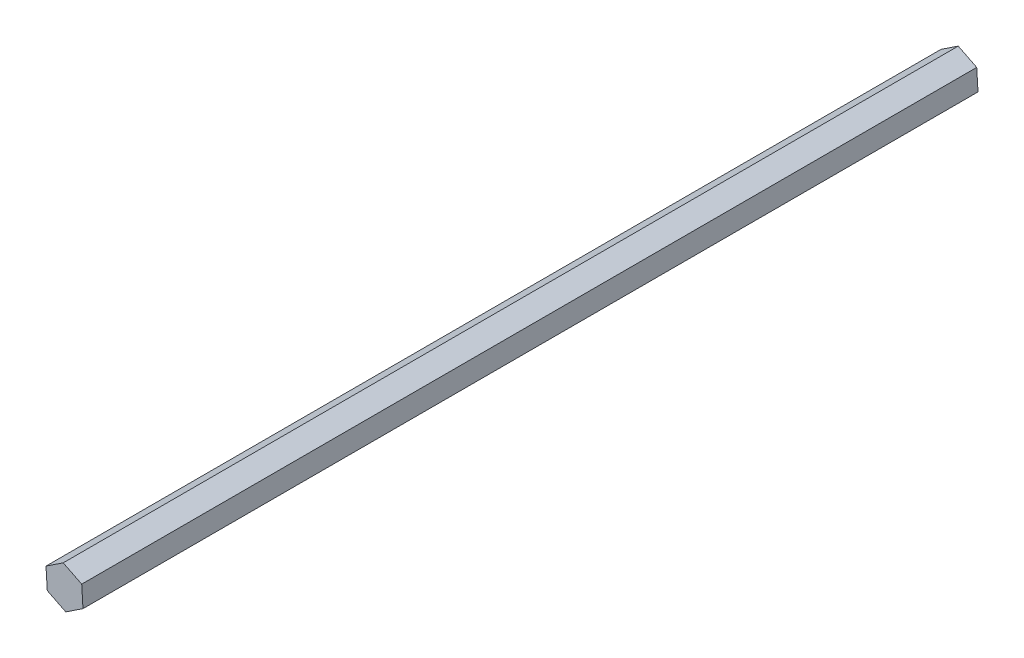
ISO-10303-21;
HEADER;
FILE_DESCRIPTION(('STEP AP214'),'2;1');
FILE_NAME('part.step','',(''),(''),'','','');
FILE_SCHEMA(('AUTOMOTIVE_DESIGN { 1 0 10303 214 1 1 1 1 }'));
ENDSEC;
DATA;
#1=APPLICATION_CONTEXT('core data for automotive mechanical design processes');
#2=APPLICATION_PROTOCOL_DEFINITION('international standard','automotive_design',2000,#1);
#3=PRODUCT_CONTEXT('',#1,'mechanical');
#4=PRODUCT('Part','Part','',(#3));
#5=PRODUCT_RELATED_PRODUCT_CATEGORY('part','',(#4));
#6=PRODUCT_DEFINITION_FORMATION('','',#4);
#7=PRODUCT_DEFINITION_CONTEXT('part definition',#1,'design');
#8=PRODUCT_DEFINITION('design','',#6,#7);
#9=PRODUCT_DEFINITION_SHAPE('','',#8);
#10=(LENGTH_UNIT() NAMED_UNIT(*) SI_UNIT(.MILLI.,.METRE.));
#11=(NAMED_UNIT(*) PLANE_ANGLE_UNIT() SI_UNIT($,.RADIAN.));
#12=(NAMED_UNIT(*) SI_UNIT($,.STERADIAN.) SOLID_ANGLE_UNIT());
#13=UNCERTAINTY_MEASURE_WITH_UNIT(LENGTH_MEASURE(1.E-05),#10,'distance_accuracy_value','');
#14=(GEOMETRIC_REPRESENTATION_CONTEXT(3) GLOBAL_UNCERTAINTY_ASSIGNED_CONTEXT((#13)) GLOBAL_UNIT_ASSIGNED_CONTEXT((#10,
#11,#12)) REPRESENTATION_CONTEXT('',''));
#15=CARTESIAN_POINT('',(0.,0.,0.));
#16=DIRECTION('',(0.,0.,1.));
#17=DIRECTION('',(1.,0.,0.));
#18=AXIS2_PLACEMENT_3D('',#15,#16,#17);
#19=CARTESIAN_POINT('',(6.12625840732226,4.0609676096607,318.55));
#20=DIRECTION('',(-0.445579810348125,-0.895242220077968,0.));
#21=DIRECTION('',(0.895242220077968,-0.445579810348125,0.));
#22=AXIS2_PLACEMENT_3D('',#19,#20,#21);
#23=PLANE('',#22);
#24=DIRECTION('',(-0.895242220077968,0.445579810348125,0.));
#25=VECTOR('',#24,1.);
#26=CARTESIAN_POINT('',(6.12625840732226,4.0609676096607,0.));
#27=LINE('',#26,#25);
#28=CARTESIAN_POINT('',(6.12625840732226,4.0609676096607,0.));
#29=VERTEX_POINT('',#28);
#30=CARTESIAN_POINT('',(-0.453771910250806,7.33597921571942,0.));
#31=VERTEX_POINT('',#30);
#32=EDGE_CURVE('E122',#29,#31,#27,.T.);
#33=ORIENTED_EDGE('',*,*,#32,.T.);
#34=DIRECTION('',(0.,0.,-1.));
#35=VECTOR('',#34,1.);
#36=CARTESIAN_POINT('',(-0.453771910250806,7.33597921571942,318.55));
#37=LINE('',#36,#35);
#38=CARTESIAN_POINT('',(-0.453771910250806,7.33597921571942,318.55));
#39=VERTEX_POINT('',#38);
#40=EDGE_CURVE('E11',#39,#31,#37,.T.);
#41=ORIENTED_EDGE('',*,*,#40,.F.);
#42=DIRECTION('',(-0.895242220077968,0.445579810348125,0.));
#43=VECTOR('',#42,1.);
#44=CARTESIAN_POINT('',(6.12625840732226,4.0609676096607,318.55));
#45=LINE('',#44,#43);
#46=CARTESIAN_POINT('',(6.12625840732226,4.0609676096607,318.55));
#47=VERTEX_POINT('',#46);
#48=EDGE_CURVE('E135',#47,#39,#45,.T.);
#49=ORIENTED_EDGE('',*,*,#48,.F.);
#50=DIRECTION('',(0.,0.,-1.));
#51=VECTOR('',#50,1.);
#52=CARTESIAN_POINT('',(6.12625840732226,4.0609676096607,318.55));
#53=LINE('',#52,#51);
#54=EDGE_CURVE('E118',#47,#29,#53,.T.);
#55=ORIENTED_EDGE('',*,*,#54,.T.);
#56=EDGE_LOOP('',(#33,#41,#49,#55));
#57=FACE_BOUND('',#56,.T.);
#58=ADVANCED_FACE('F39',(#57),#23,.F.);
#59=CARTESIAN_POINT('',(-0.453771910250806,7.33597921571942,318.55));
#60=DIRECTION('',(0.552512599953837,-0.833504545213913,0.));
#61=DIRECTION('',(0.833504545213913,0.552512599953837,0.));
#62=AXIS2_PLACEMENT_3D('',#59,#60,#61);
#63=PLANE('',#62);
#64=DIRECTION('',(-0.833504545213913,-0.552512599953837,0.));
#65=VECTOR('',#64,1.);
#66=CARTESIAN_POINT('',(-0.453771910250806,7.33597921571942,0.));
#67=LINE('',#66,#65);
#68=CARTESIAN_POINT('',(-6.58003031757306,3.27501160605872,0.));
#69=VERTEX_POINT('',#68);
#70=EDGE_CURVE('E127',#31,#69,#67,.T.);
#71=ORIENTED_EDGE('',*,*,#70,.T.);
#72=DIRECTION('',(0.,0.,-1.));
#73=VECTOR('',#72,1.);
#74=CARTESIAN_POINT('',(-6.58003031757306,3.27501160605872,318.55));
#75=LINE('',#74,#73);
#76=CARTESIAN_POINT('',(-6.58003031757306,3.27501160605872,318.55));
#77=VERTEX_POINT('',#76);
#78=EDGE_CURVE('E50',#77,#69,#75,.T.);
#79=ORIENTED_EDGE('',*,*,#78,.F.);
#80=DIRECTION('',(-0.833504545213913,-0.552512599953837,0.));
#81=VECTOR('',#80,1.);
#82=CARTESIAN_POINT('',(-0.453771910250806,7.33597921571942,318.55));
#83=LINE('',#82,#81);
#84=EDGE_CURVE('E95',#39,#77,#83,.T.);
#85=ORIENTED_EDGE('',*,*,#84,.F.);
#86=ORIENTED_EDGE('',*,*,#40,.T.);
#87=EDGE_LOOP('',(#71,#79,#85,#86));
#88=FACE_BOUND('',#87,.T.);
#89=ADVANCED_FACE('F160',(#88),#63,.F.);
#90=CARTESIAN_POINT('',(-6.58003031757306,3.27501160605872,318.55));
#91=DIRECTION('',(0.998092410301962,0.0617376748640551,0.));
#92=DIRECTION('',(-0.0617376748640551,0.998092410301962,0.));
#93=AXIS2_PLACEMENT_3D('',#90,#91,#92);
#94=PLANE('',#93);
#95=DIRECTION('',(0.0617376748640551,-0.998092410301962,0.));
#96=VECTOR('',#95,1.);
#97=CARTESIAN_POINT('',(-6.58003031757306,3.27501160605872,0.));
#98=LINE('',#97,#96);
#99=CARTESIAN_POINT('',(-6.12625840732226,-4.0609676096607,0.));
#100=VERTEX_POINT('',#99);
#101=EDGE_CURVE('E126',#69,#100,#98,.T.);
#102=ORIENTED_EDGE('',*,*,#101,.T.);
#103=DIRECTION('',(0.,0.,-1.));
#104=VECTOR('',#103,1.);
#105=CARTESIAN_POINT('',(-6.12625840732226,-4.0609676096607,318.55));
#106=LINE('',#105,#104);
#107=CARTESIAN_POINT('',(-6.12625840732226,-4.0609676096607,318.55));
#108=VERTEX_POINT('',#107);
#109=EDGE_CURVE('E111',#108,#100,#106,.T.);
#110=ORIENTED_EDGE('',*,*,#109,.F.);
#111=DIRECTION('',(0.0617376748640551,-0.998092410301962,0.));
#112=VECTOR('',#111,1.);
#113=CARTESIAN_POINT('',(-6.58003031757306,3.27501160605872,318.55));
#114=LINE('',#113,#112);
#115=EDGE_CURVE('E104',#77,#108,#114,.T.);
#116=ORIENTED_EDGE('',*,*,#115,.F.);
#117=ORIENTED_EDGE('',*,*,#78,.T.);
#118=EDGE_LOOP('',(#102,#110,#116,#117));
#119=FACE_BOUND('',#118,.T.);
#120=ADVANCED_FACE('F138',(#119),#94,.F.);
#121=CARTESIAN_POINT('',(-6.12625840732226,-4.0609676096607,318.55));
#122=DIRECTION('',(0.445579810348126,0.895242220077968,0.));
#123=DIRECTION('',(-0.895242220077968,0.445579810348126,0.));
#124=AXIS2_PLACEMENT_3D('',#121,#122,#123);
#125=PLANE('',#124);
#126=DIRECTION('',(0.895242220077968,-0.445579810348126,0.));
#127=VECTOR('',#126,1.);
#128=CARTESIAN_POINT('',(-6.12625840732226,-4.0609676096607,0.));
#129=LINE('',#128,#127);
#130=CARTESIAN_POINT('',(0.453771910250804,-7.33597921571942,0.));
#131=VERTEX_POINT('',#130);
#132=EDGE_CURVE('E114',#100,#131,#129,.T.);
#133=ORIENTED_EDGE('',*,*,#132,.T.);
#134=DIRECTION('',(0.,0.,-1.));
#135=VECTOR('',#134,1.);
#136=CARTESIAN_POINT('',(0.453771910250804,-7.33597921571942,318.55));
#137=LINE('',#136,#135);
#138=CARTESIAN_POINT('',(0.453771910250804,-7.33597921571942,318.55));
#139=VERTEX_POINT('',#138);
#140=EDGE_CURVE('E109',#139,#131,#137,.T.);
#141=ORIENTED_EDGE('',*,*,#140,.F.);
#142=DIRECTION('',(0.895242220077968,-0.445579810348126,0.));
#143=VECTOR('',#142,1.);
#144=CARTESIAN_POINT('',(-6.12625840732226,-4.0609676096607,318.55));
#145=LINE('',#144,#143);
#146=EDGE_CURVE('E97',#108,#139,#145,.T.);
#147=ORIENTED_EDGE('',*,*,#146,.F.);
#148=ORIENTED_EDGE('',*,*,#109,.T.);
#149=EDGE_LOOP('',(#133,#141,#147,#148));
#150=FACE_BOUND('',#149,.T.);
#151=ADVANCED_FACE('F112',(#150),#125,.F.);
#152=CARTESIAN_POINT('',(0.453771910250804,-7.33597921571942,318.55));
#153=DIRECTION('',(-0.552512599953837,0.833504545213913,0.));
#154=DIRECTION('',(-0.833504545213913,-0.552512599953837,0.));
#155=AXIS2_PLACEMENT_3D('',#152,#153,#154);
#156=PLANE('',#155);
#157=DIRECTION('',(0.833504545213913,0.552512599953837,0.));
#158=VECTOR('',#157,1.);
#159=CARTESIAN_POINT('',(0.453771910250804,-7.33597921571942,0.));
#160=LINE('',#159,#158);
#161=CARTESIAN_POINT('',(6.58003031757306,-3.27501160605872,0.));
#162=VERTEX_POINT('',#161);
#163=EDGE_CURVE('E80',#131,#162,#160,.T.);
#164=ORIENTED_EDGE('',*,*,#163,.T.);
#165=DIRECTION('',(0.,0.,-1.));
#166=VECTOR('',#165,1.);
#167=CARTESIAN_POINT('',(6.58003031757306,-3.27501160605872,318.55));
#168=LINE('',#167,#166);
#169=CARTESIAN_POINT('',(6.58003031757306,-3.27501160605872,318.55));
#170=VERTEX_POINT('',#169);
#171=EDGE_CURVE('E113',#170,#162,#168,.T.);
#172=ORIENTED_EDGE('',*,*,#171,.F.);
#173=DIRECTION('',(0.833504545213913,0.552512599953837,0.));
#174=VECTOR('',#173,1.);
#175=CARTESIAN_POINT('',(0.453771910250804,-7.33597921571942,318.55));
#176=LINE('',#175,#174);
#177=EDGE_CURVE('E103',#139,#170,#176,.T.);
#178=ORIENTED_EDGE('',*,*,#177,.F.);
#179=ORIENTED_EDGE('',*,*,#140,.T.);
#180=EDGE_LOOP('',(#164,#172,#178,#179));
#181=FACE_BOUND('',#180,.T.);
#182=ADVANCED_FACE('F116',(#181),#156,.F.);
#183=CARTESIAN_POINT('',(6.58003031757306,-3.27501160605872,318.55));
#184=DIRECTION('',(-0.998092410301962,-0.0617376748640547,0.));
#185=DIRECTION('',(0.0617376748640547,-0.998092410301962,0.));
#186=AXIS2_PLACEMENT_3D('',#183,#184,#185);
#187=PLANE('',#186);
#188=DIRECTION('',(-0.0617376748640547,0.998092410301962,0.));
#189=VECTOR('',#188,1.);
#190=CARTESIAN_POINT('',(6.58003031757306,-3.27501160605872,0.));
#191=LINE('',#190,#189);
#192=EDGE_CURVE('E83',#162,#29,#191,.T.);
#193=ORIENTED_EDGE('',*,*,#192,.T.);
#194=ORIENTED_EDGE('',*,*,#54,.F.);
#195=DIRECTION('',(-0.0617376748640547,0.998092410301962,0.));
#196=VECTOR('',#195,1.);
#197=CARTESIAN_POINT('',(6.58003031757306,-3.27501160605872,318.55));
#198=LINE('',#197,#196);
#199=EDGE_CURVE('E54',#170,#47,#198,.T.);
#200=ORIENTED_EDGE('',*,*,#199,.F.);
#201=ORIENTED_EDGE('',*,*,#171,.T.);
#202=EDGE_LOOP('',(#193,#194,#200,#201));
#203=FACE_BOUND('',#202,.T.);
#204=ADVANCED_FACE('F148',(#203),#187,.F.);
#205=CARTESIAN_POINT('',(0.,0.,318.55));
#206=DIRECTION('',(0.,0.,1.));
#207=DIRECTION('',(1.,0.,0.));
#208=AXIS2_PLACEMENT_3D('',#205,#206,#207);
#209=PLANE('',#208);
#210=ORIENTED_EDGE('',*,*,#48,.T.);
#211=ORIENTED_EDGE('',*,*,#84,.T.);
#212=ORIENTED_EDGE('',*,*,#115,.T.);
#213=ORIENTED_EDGE('',*,*,#146,.T.);
#214=ORIENTED_EDGE('',*,*,#177,.T.);
#215=ORIENTED_EDGE('',*,*,#199,.T.);
#216=EDGE_LOOP('',(#210,#211,#212,#213,#214,#215));
#217=FACE_BOUND('',#216,.T.);
#218=ADVANCED_FACE('F101',(#217),#209,.T.);
#219=CARTESIAN_POINT('',(0.,0.,0.));
#220=DIRECTION('',(0.,0.,1.));
#221=DIRECTION('',(1.,0.,0.));
#222=AXIS2_PLACEMENT_3D('',#219,#220,#221);
#223=PLANE('',#222);
#224=ORIENTED_EDGE('',*,*,#32,.F.);
#225=ORIENTED_EDGE('',*,*,#192,.F.);
#226=ORIENTED_EDGE('',*,*,#163,.F.);
#227=ORIENTED_EDGE('',*,*,#132,.F.);
#228=ORIENTED_EDGE('',*,*,#101,.F.);
#229=ORIENTED_EDGE('',*,*,#70,.F.);
#230=EDGE_LOOP('',(#224,#225,#226,#227,#228,#229));
#231=FACE_BOUND('',#230,.T.);
#232=ADVANCED_FACE('F142',(#231),#223,.F.);
#233=CLOSED_SHELL('',(#58,#89,#120,#151,#182,#204,#218,#232));
#234=MANIFOLD_SOLID_BREP('B2',#233);
#235=ADVANCED_BREP_SHAPE_REPRESENTATION('',(#18,#234),#14);
#236=SHAPE_DEFINITION_REPRESENTATION(#9,#235);
ENDSEC;
END-ISO-10303-21;
